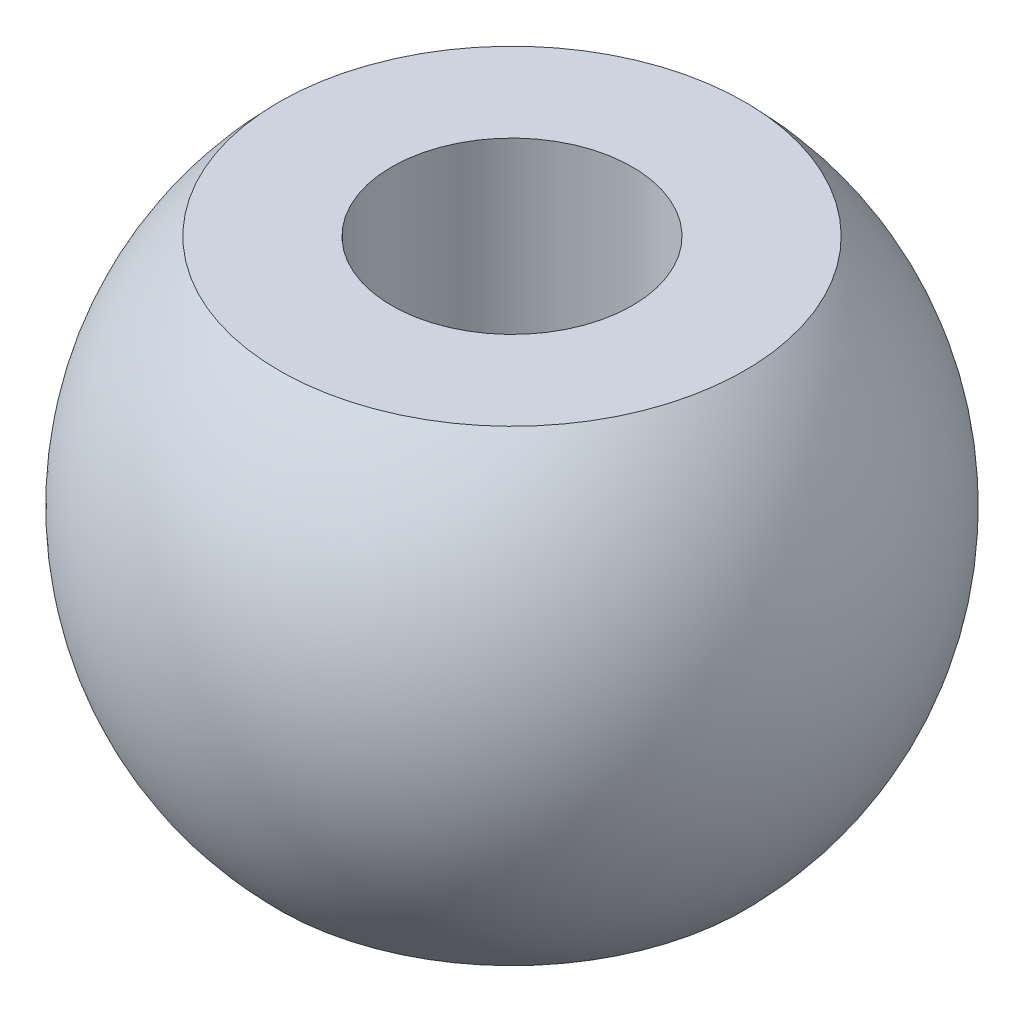
ISO-10303-21;
HEADER;
FILE_DESCRIPTION(('STEP AP214'),'2;1');
FILE_NAME('part.step','',(''),(''),'','','');
FILE_SCHEMA(('AUTOMOTIVE_DESIGN { 1 0 10303 214 1 1 1 1 }'));
ENDSEC;
DATA;
#1=APPLICATION_CONTEXT('core data for automotive mechanical design processes');
#2=APPLICATION_PROTOCOL_DEFINITION('international standard','automotive_design',2000,#1);
#3=PRODUCT_CONTEXT('',#1,'mechanical');
#4=PRODUCT('Part','Part','',(#3));
#5=PRODUCT_RELATED_PRODUCT_CATEGORY('part','',(#4));
#6=PRODUCT_DEFINITION_FORMATION('','',#4);
#7=PRODUCT_DEFINITION_CONTEXT('part definition',#1,'design');
#8=PRODUCT_DEFINITION('design','',#6,#7);
#9=PRODUCT_DEFINITION_SHAPE('','',#8);
#10=(LENGTH_UNIT() NAMED_UNIT(*) SI_UNIT(.MILLI.,.METRE.));
#11=(NAMED_UNIT(*) PLANE_ANGLE_UNIT() SI_UNIT($,.RADIAN.));
#12=(NAMED_UNIT(*) SI_UNIT($,.STERADIAN.) SOLID_ANGLE_UNIT());
#13=UNCERTAINTY_MEASURE_WITH_UNIT(LENGTH_MEASURE(1.E-05),#10,'distance_accuracy_value','');
#14=(GEOMETRIC_REPRESENTATION_CONTEXT(3) GLOBAL_UNCERTAINTY_ASSIGNED_CONTEXT((#13)) GLOBAL_UNIT_ASSIGNED_CONTEXT((#10,
#11,#12)) REPRESENTATION_CONTEXT('',''));
#15=CARTESIAN_POINT('',(0.,0.,0.));
#16=DIRECTION('',(0.,0.,1.));
#17=DIRECTION('',(1.,0.,0.));
#18=AXIS2_PLACEMENT_3D('',#15,#16,#17);
#19=CARTESIAN_POINT('',(0.,6.02079728939615,0.));
#20=DIRECTION('',(0.,1.,0.));
#21=DIRECTION('',(-1.,0.,0.));
#22=AXIS2_PLACEMENT_3D('',#19,#20,#21);
#23=PLANE('',#22);
#24=CARTESIAN_POINT('',(0.,6.02079728939615,0.));
#25=DIRECTION('',(0.,1.,0.));
#26=DIRECTION('',(-1.,0.,0.));
#27=AXIS2_PLACEMENT_3D('',#24,#25,#26);
#28=CIRCLE('',#27,3.1);
#29=CARTESIAN_POINT('',(-3.1,6.02079728939615,0.));
#30=VERTEX_POINT('',#29);
#31=EDGE_CURVE('E54',#30,#30,#28,.T.);
#32=ORIENTED_EDGE('',*,*,#31,.F.);
#33=EDGE_LOOP('',(#32));
#34=FACE_BOUND('',#33,.T.);
#35=CARTESIAN_POINT('',(0.,6.02079728939615,0.));
#36=DIRECTION('',(0.,1.,0.));
#37=DIRECTION('',(-1.,0.,0.));
#38=AXIS2_PLACEMENT_3D('',#35,#36,#37);
#39=CIRCLE('',#38,6.);
#40=CARTESIAN_POINT('',(-6.,6.02079728939615,0.));
#41=VERTEX_POINT('',#40);
#42=EDGE_CURVE('E10',#41,#41,#39,.T.);
#43=ORIENTED_EDGE('',*,*,#42,.T.);
#44=EDGE_LOOP('',(#43));
#45=FACE_BOUND('',#44,.T.);
#46=ADVANCED_FACE('F37',(#34,#45),#23,.T.);
#47=CARTESIAN_POINT('',(0.,0.,0.));
#48=DIRECTION('',(0.,1.,0.));
#49=DIRECTION('',(-1.,0.,0.));
#50=AXIS2_PLACEMENT_3D('',#47,#48,#49);
#51=SPHERICAL_SURFACE('',#50,8.5);
#52=CARTESIAN_POINT('',(0.,-6.02079728939615,0.));
#53=DIRECTION('',(0.,1.,0.));
#54=DIRECTION('',(-1.,0.,0.));
#55=AXIS2_PLACEMENT_3D('',#52,#53,#54);
#56=CIRCLE('',#55,6.);
#57=CARTESIAN_POINT('',(-6.,-6.02079728939615,0.));
#58=VERTEX_POINT('',#57);
#59=EDGE_CURVE('E44',#58,#58,#56,.T.);
#60=ORIENTED_EDGE('',*,*,#59,.T.);
#61=EDGE_LOOP('',(#60));
#62=FACE_BOUND('',#61,.T.);
#63=ORIENTED_EDGE('',*,*,#42,.F.);
#64=EDGE_LOOP('',(#63));
#65=FACE_BOUND('',#64,.T.);
#66=ADVANCED_FACE('F64',(#62,#65),#51,.T.);
#67=CARTESIAN_POINT('',(-6.,-6.02079728939615,0.));
#68=DIRECTION('',(0.,-1.,0.));
#69=DIRECTION('',(1.,0.,0.));
#70=AXIS2_PLACEMENT_3D('',#67,#68,#69);
#71=PLANE('',#70);
#72=CARTESIAN_POINT('',(0.,-6.02079728939615,0.));
#73=DIRECTION('',(0.,1.,0.));
#74=DIRECTION('',(-1.,0.,0.));
#75=AXIS2_PLACEMENT_3D('',#72,#73,#74);
#76=CIRCLE('',#75,3.1);
#77=CARTESIAN_POINT('',(-3.1,-6.02079728939615,0.));
#78=VERTEX_POINT('',#77);
#79=EDGE_CURVE('E49',#78,#78,#76,.T.);
#80=ORIENTED_EDGE('',*,*,#79,.T.);
#81=EDGE_LOOP('',(#80));
#82=FACE_BOUND('',#81,.T.);
#83=ORIENTED_EDGE('',*,*,#59,.F.);
#84=EDGE_LOOP('',(#83));
#85=FACE_BOUND('',#84,.T.);
#86=ADVANCED_FACE('F68',(#82,#85),#71,.T.);
#87=CARTESIAN_POINT('',(0.,-6.02079728939615,0.));
#88=DIRECTION('',(0.,1.,0.));
#89=DIRECTION('',(-1.,0.,0.));
#90=AXIS2_PLACEMENT_3D('',#87,#88,#89);
#91=CYLINDRICAL_SURFACE('',#90,3.1);
#92=ORIENTED_EDGE('',*,*,#79,.F.);
#93=EDGE_LOOP('',(#92));
#94=FACE_BOUND('',#93,.T.);
#95=ORIENTED_EDGE('',*,*,#31,.T.);
#96=EDGE_LOOP('',(#95));
#97=FACE_BOUND('',#96,.T.);
#98=ADVANCED_FACE('F61',(#94,#97),#91,.F.);
#99=CLOSED_SHELL('',(#46,#66,#86,#98));
#100=MANIFOLD_SOLID_BREP('B2',#99);
#101=ADVANCED_BREP_SHAPE_REPRESENTATION('',(#18,#100),#14);
#102=SHAPE_DEFINITION_REPRESENTATION(#9,#101);
ENDSEC;
END-ISO-10303-21;
